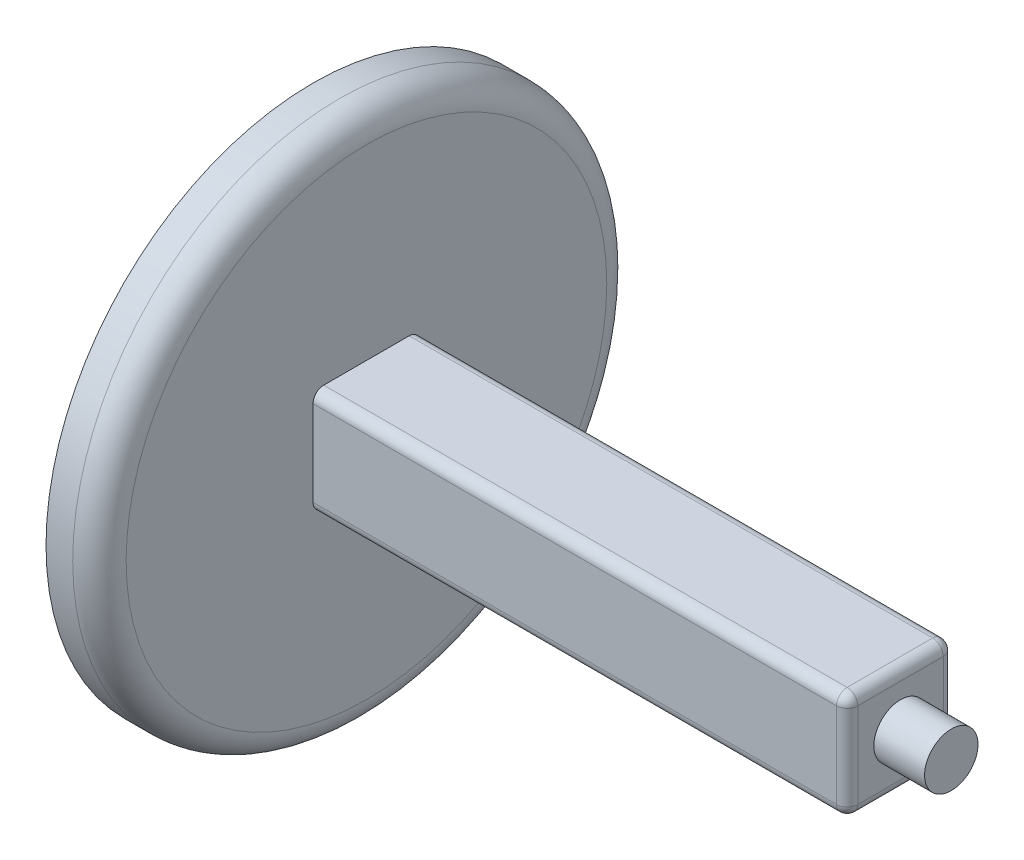
ISO-10303-21;
HEADER;
FILE_DESCRIPTION(('STEP AP214'),'2;1');
FILE_NAME('part.step','',(''),(''),'','','');
FILE_SCHEMA(('AUTOMOTIVE_DESIGN { 1 0 10303 214 1 1 1 1 }'));
ENDSEC;
DATA;
#1=APPLICATION_CONTEXT('core data for automotive mechanical design processes');
#2=APPLICATION_PROTOCOL_DEFINITION('international standard','automotive_design',2000,#1);
#3=PRODUCT_CONTEXT('',#1,'mechanical');
#4=PRODUCT('Part','Part','',(#3));
#5=PRODUCT_RELATED_PRODUCT_CATEGORY('part','',(#4));
#6=PRODUCT_DEFINITION_FORMATION('','',#4);
#7=PRODUCT_DEFINITION_CONTEXT('part definition',#1,'design');
#8=PRODUCT_DEFINITION('design','',#6,#7);
#9=PRODUCT_DEFINITION_SHAPE('','',#8);
#10=(LENGTH_UNIT() NAMED_UNIT(*) SI_UNIT(.MILLI.,.METRE.));
#11=(NAMED_UNIT(*) PLANE_ANGLE_UNIT() SI_UNIT($,.RADIAN.));
#12=(NAMED_UNIT(*) SI_UNIT($,.STERADIAN.) SOLID_ANGLE_UNIT());
#13=UNCERTAINTY_MEASURE_WITH_UNIT(LENGTH_MEASURE(1.E-05),#10,'distance_accuracy_value','');
#14=(GEOMETRIC_REPRESENTATION_CONTEXT(3) GLOBAL_UNCERTAINTY_ASSIGNED_CONTEXT((#13)) GLOBAL_UNIT_ASSIGNED_CONTEXT((#10,
#11,#12)) REPRESENTATION_CONTEXT('',''));
#15=CARTESIAN_POINT('',(0.,0.,0.));
#16=DIRECTION('',(0.,0.,1.));
#17=DIRECTION('',(1.,0.,0.));
#18=AXIS2_PLACEMENT_3D('',#15,#16,#17);
#19=CARTESIAN_POINT('',(100.,0.,0.));
#20=DIRECTION('',(-1.,0.,0.));
#21=DIRECTION('',(0.,0.,1.));
#22=AXIS2_PLACEMENT_3D('',#19,#20,#21);
#23=CYLINDRICAL_SURFACE('',#22,500.);
#24=CARTESIAN_POINT('',(50.,0.,0.));
#25=DIRECTION('',(1.,0.,0.));
#26=DIRECTION('',(0.,0.,-1.));
#27=AXIS2_PLACEMENT_3D('',#24,#25,#26);
#28=CIRCLE('',#27,500.);
#29=CARTESIAN_POINT('',(50.,0.,-500.));
#30=VERTEX_POINT('',#29);
#31=EDGE_CURVE('E163',#30,#30,#28,.F.);
#32=ORIENTED_EDGE('',*,*,#31,.T.);
#33=EDGE_LOOP('',(#32));
#34=FACE_BOUND('',#33,.T.);
#35=CARTESIAN_POINT('',(0.,0.,0.));
#36=DIRECTION('',(1.,0.,0.));
#37=DIRECTION('',(0.,0.,-1.));
#38=AXIS2_PLACEMENT_3D('',#35,#36,#37);
#39=CIRCLE('',#38,500.);
#40=CARTESIAN_POINT('',(0.,0.,-500.));
#41=VERTEX_POINT('',#40);
#42=EDGE_CURVE('E156',#41,#41,#39,.T.);
#43=ORIENTED_EDGE('',*,*,#42,.T.);
#44=EDGE_LOOP('',(#43));
#45=FACE_BOUND('',#44,.T.);
#46=ADVANCED_FACE('F35',(#34,#45),#23,.T.);
#47=CARTESIAN_POINT('',(100.,0.,0.));
#48=DIRECTION('',(1.,0.,0.));
#49=DIRECTION('',(0.,0.,-1.));
#50=AXIS2_PLACEMENT_3D('',#47,#48,#49);
#51=PLANE('',#50);
#52=CARTESIAN_POINT('',(100.,0.,0.));
#53=DIRECTION('',(1.,0.,0.));
#54=DIRECTION('',(0.,0.,-1.));
#55=AXIS2_PLACEMENT_3D('',#52,#53,#54);
#56=CIRCLE('',#55,450.);
#57=CARTESIAN_POINT('',(100.,0.,-450.));
#58=VERTEX_POINT('',#57);
#59=EDGE_CURVE('E160',#58,#58,#56,.T.);
#60=ORIENTED_EDGE('',*,*,#59,.T.);
#61=EDGE_LOOP('',(#60));
#62=FACE_BOUND('',#61,.T.);
#63=DIRECTION('',(0.,1.,0.));
#64=VECTOR('',#63,1.);
#65=CARTESIAN_POINT('',(100.,-100.,-100.));
#66=LINE('',#65,#64);
#67=CARTESIAN_POINT('',(100.,-80.,-100.));
#68=VERTEX_POINT('',#67);
#69=CARTESIAN_POINT('',(100.,80.,-100.));
#70=VERTEX_POINT('',#69);
#71=EDGE_CURVE('E145',#68,#70,#66,.T.);
#72=ORIENTED_EDGE('',*,*,#71,.F.);
#73=CARTESIAN_POINT('',(100.,-80.,-80.));
#74=DIRECTION('',(1.,0.,0.));
#75=DIRECTION('',(0.,0.,-1.));
#76=AXIS2_PLACEMENT_3D('',#73,#74,#75);
#77=CIRCLE('',#76,20.);
#78=CARTESIAN_POINT('',(100.,-100.,-80.));
#79=VERTEX_POINT('',#78);
#80=EDGE_CURVE('E137',#68,#79,#77,.F.);
#81=ORIENTED_EDGE('',*,*,#80,.T.);
#82=DIRECTION('',(0.,0.,-1.));
#83=VECTOR('',#82,1.);
#84=CARTESIAN_POINT('',(100.,-100.,100.));
#85=LINE('',#84,#83);
#86=CARTESIAN_POINT('',(100.,-100.,80.));
#87=VERTEX_POINT('',#86);
#88=EDGE_CURVE('E148',#87,#79,#85,.T.);
#89=ORIENTED_EDGE('',*,*,#88,.F.);
#90=CARTESIAN_POINT('',(100.,-80.,80.));
#91=DIRECTION('',(1.,0.,0.));
#92=DIRECTION('',(0.,0.,-1.));
#93=AXIS2_PLACEMENT_3D('',#90,#91,#92);
#94=CIRCLE('',#93,20.);
#95=CARTESIAN_POINT('',(100.,-80.,100.));
#96=VERTEX_POINT('',#95);
#97=EDGE_CURVE('E178',#87,#96,#94,.F.);
#98=ORIENTED_EDGE('',*,*,#97,.T.);
#99=DIRECTION('',(0.,-1.,0.));
#100=VECTOR('',#99,1.);
#101=CARTESIAN_POINT('',(100.,-100.,100.));
#102=LINE('',#101,#100);
#103=CARTESIAN_POINT('',(100.,80.,100.));
#104=VERTEX_POINT('',#103);
#105=EDGE_CURVE('E144',#104,#96,#102,.T.);
#106=ORIENTED_EDGE('',*,*,#105,.F.);
#107=CARTESIAN_POINT('',(100.,80.,80.));
#108=DIRECTION('',(1.,0.,0.));
#109=DIRECTION('',(0.,0.,-1.));
#110=AXIS2_PLACEMENT_3D('',#107,#108,#109);
#111=CIRCLE('',#110,20.);
#112=CARTESIAN_POINT('',(100.,100.,80.));
#113=VERTEX_POINT('',#112);
#114=EDGE_CURVE('E143',#104,#113,#111,.F.);
#115=ORIENTED_EDGE('',*,*,#114,.T.);
#116=DIRECTION('',(0.,0.,1.));
#117=VECTOR('',#116,1.);
#118=CARTESIAN_POINT('',(100.,100.,100.));
#119=LINE('',#118,#117);
#120=CARTESIAN_POINT('',(100.,100.,-80.));
#121=VERTEX_POINT('',#120);
#122=EDGE_CURVE('E121',#121,#113,#119,.T.);
#123=ORIENTED_EDGE('',*,*,#122,.F.);
#124=CARTESIAN_POINT('',(100.,80.,-80.));
#125=DIRECTION('',(1.,0.,0.));
#126=DIRECTION('',(0.,0.,-1.));
#127=AXIS2_PLACEMENT_3D('',#124,#125,#126);
#128=CIRCLE('',#127,20.);
#129=EDGE_CURVE('E130',#121,#70,#128,.F.);
#130=ORIENTED_EDGE('',*,*,#129,.T.);
#131=EDGE_LOOP('',(#72,#81,#89,#98,#106,#115,#123,#130));
#132=FACE_BOUND('',#131,.T.);
#133=ADVANCED_FACE('F140',(#62,#132),#51,.T.);
#134=CARTESIAN_POINT('',(0.,0.,0.));
#135=DIRECTION('',(1.,0.,0.));
#136=DIRECTION('',(0.,0.,-1.));
#137=AXIS2_PLACEMENT_3D('',#134,#135,#136);
#138=PLANE('',#137);
#139=ORIENTED_EDGE('',*,*,#42,.F.);
#140=EDGE_LOOP('',(#139));
#141=FACE_BOUND('',#140,.T.);
#142=ADVANCED_FACE('F258',(#141),#138,.F.);
#143=CARTESIAN_POINT('',(1100.,-100.,-100.));
#144=DIRECTION('',(0.,0.,1.));
#145=DIRECTION('',(1.,0.,0.));
#146=AXIS2_PLACEMENT_3D('',#143,#144,#145);
#147=PLANE('',#146);
#148=DIRECTION('',(-1.,0.,0.));
#149=VECTOR('',#148,1.);
#150=CARTESIAN_POINT('',(1100.,80.,-100.));
#151=LINE('',#150,#149);
#152=CARTESIAN_POINT('',(1080.,80.,-100.));
#153=VERTEX_POINT('',#152);
#154=EDGE_CURVE('E133',#70,#153,#151,.F.);
#155=ORIENTED_EDGE('',*,*,#154,.T.);
#156=DIRECTION('',(0.,1.,0.));
#157=VECTOR('',#156,1.);
#158=CARTESIAN_POINT('',(1080.,-100.,-100.));
#159=LINE('',#158,#157);
#160=CARTESIAN_POINT('',(1080.,-80.,-100.));
#161=VERTEX_POINT('',#160);
#162=EDGE_CURVE('E191',#153,#161,#159,.F.);
#163=ORIENTED_EDGE('',*,*,#162,.T.);
#164=DIRECTION('',(-1.,0.,0.));
#165=VECTOR('',#164,1.);
#166=CARTESIAN_POINT('',(1100.,-80.,-100.));
#167=LINE('',#166,#165);
#168=EDGE_CURVE('E126',#161,#68,#167,.T.);
#169=ORIENTED_EDGE('',*,*,#168,.T.);
#170=ORIENTED_EDGE('',*,*,#71,.T.);
#171=EDGE_LOOP('',(#155,#163,#169,#170));
#172=FACE_BOUND('',#171,.T.);
#173=ADVANCED_FACE('F323',(#172),#147,.F.);
#174=CARTESIAN_POINT('',(1100.,100.,100.));
#175=DIRECTION('',(0.,-1.,0.));
#176=DIRECTION('',(0.,0.,-1.));
#177=AXIS2_PLACEMENT_3D('',#174,#175,#176);
#178=PLANE('',#177);
#179=DIRECTION('',(-1.,0.,0.));
#180=VECTOR('',#179,1.);
#181=CARTESIAN_POINT('',(1100.,100.,80.));
#182=LINE('',#181,#180);
#183=CARTESIAN_POINT('',(1080.,100.,80.));
#184=VERTEX_POINT('',#183);
#185=EDGE_CURVE('E127',#113,#184,#182,.F.);
#186=ORIENTED_EDGE('',*,*,#185,.T.);
#187=DIRECTION('',(0.,0.,1.));
#188=VECTOR('',#187,1.);
#189=CARTESIAN_POINT('',(1080.,100.,100.));
#190=LINE('',#189,#188);
#191=CARTESIAN_POINT('',(1080.,100.,-80.));
#192=VERTEX_POINT('',#191);
#193=EDGE_CURVE('E124',#184,#192,#190,.F.);
#194=ORIENTED_EDGE('',*,*,#193,.T.);
#195=DIRECTION('',(-1.,0.,0.));
#196=VECTOR('',#195,1.);
#197=CARTESIAN_POINT('',(1100.,100.,-80.));
#198=LINE('',#197,#196);
#199=EDGE_CURVE('E116',#192,#121,#198,.T.);
#200=ORIENTED_EDGE('',*,*,#199,.T.);
#201=ORIENTED_EDGE('',*,*,#122,.T.);
#202=EDGE_LOOP('',(#186,#194,#200,#201));
#203=FACE_BOUND('',#202,.T.);
#204=ADVANCED_FACE('F119',(#203),#178,.F.);
#205=CARTESIAN_POINT('',(1100.,-100.,100.));
#206=DIRECTION('',(0.,0.,-1.));
#207=DIRECTION('',(-1.,0.,0.));
#208=AXIS2_PLACEMENT_3D('',#205,#206,#207);
#209=PLANE('',#208);
#210=DIRECTION('',(-1.,0.,0.));
#211=VECTOR('',#210,1.);
#212=CARTESIAN_POINT('',(1100.,-80.,100.));
#213=LINE('',#212,#211);
#214=CARTESIAN_POINT('',(1080.,-80.,100.));
#215=VERTEX_POINT('',#214);
#216=EDGE_CURVE('E138',#96,#215,#213,.F.);
#217=ORIENTED_EDGE('',*,*,#216,.T.);
#218=DIRECTION('',(0.,-1.,0.));
#219=VECTOR('',#218,1.);
#220=CARTESIAN_POINT('',(1080.,-100.,100.));
#221=LINE('',#220,#219);
#222=CARTESIAN_POINT('',(1080.,80.,100.));
#223=VERTEX_POINT('',#222);
#224=EDGE_CURVE('E52',#215,#223,#221,.F.);
#225=ORIENTED_EDGE('',*,*,#224,.T.);
#226=DIRECTION('',(-1.,0.,0.));
#227=VECTOR('',#226,1.);
#228=CARTESIAN_POINT('',(1100.,80.,100.));
#229=LINE('',#228,#227);
#230=EDGE_CURVE('E174',#223,#104,#229,.T.);
#231=ORIENTED_EDGE('',*,*,#230,.T.);
#232=ORIENTED_EDGE('',*,*,#105,.T.);
#233=EDGE_LOOP('',(#217,#225,#231,#232));
#234=FACE_BOUND('',#233,.T.);
#235=ADVANCED_FACE('F247',(#234),#209,.F.);
#236=CARTESIAN_POINT('',(1100.,-100.,100.));
#237=DIRECTION('',(0.,1.,0.));
#238=DIRECTION('',(0.,0.,1.));
#239=AXIS2_PLACEMENT_3D('',#236,#237,#238);
#240=PLANE('',#239);
#241=DIRECTION('',(-1.,0.,0.));
#242=VECTOR('',#241,1.);
#243=CARTESIAN_POINT('',(1100.,-100.,-80.));
#244=LINE('',#243,#242);
#245=CARTESIAN_POINT('',(1080.,-100.,-80.));
#246=VERTEX_POINT('',#245);
#247=EDGE_CURVE('E171',#79,#246,#244,.F.);
#248=ORIENTED_EDGE('',*,*,#247,.T.);
#249=DIRECTION('',(0.,0.,-1.));
#250=VECTOR('',#249,1.);
#251=CARTESIAN_POINT('',(1080.,-100.,100.));
#252=LINE('',#251,#250);
#253=CARTESIAN_POINT('',(1080.,-100.,80.));
#254=VERTEX_POINT('',#253);
#255=EDGE_CURVE('E193',#246,#254,#252,.F.);
#256=ORIENTED_EDGE('',*,*,#255,.T.);
#257=DIRECTION('',(-1.,0.,0.));
#258=VECTOR('',#257,1.);
#259=CARTESIAN_POINT('',(1100.,-100.,80.));
#260=LINE('',#259,#258);
#261=EDGE_CURVE('E169',#254,#87,#260,.T.);
#262=ORIENTED_EDGE('',*,*,#261,.T.);
#263=ORIENTED_EDGE('',*,*,#88,.T.);
#264=EDGE_LOOP('',(#248,#256,#262,#263));
#265=FACE_BOUND('',#264,.T.);
#266=ADVANCED_FACE('F236',(#265),#240,.F.);
#267=CARTESIAN_POINT('',(1100.,0.,0.));
#268=DIRECTION('',(-1.,0.,0.));
#269=DIRECTION('',(0.,0.,1.));
#270=AXIS2_PLACEMENT_3D('',#267,#268,#269);
#271=PLANE('',#270);
#272=DIRECTION('',(0.,1.,0.));
#273=VECTOR('',#272,1.);
#274=CARTESIAN_POINT('',(1100.,0.,-80.));
#275=LINE('',#274,#273);
#276=CARTESIAN_POINT('',(1100.,-80.,-80.));
#277=VERTEX_POINT('',#276);
#278=CARTESIAN_POINT('',(1100.,80.,-80.));
#279=VERTEX_POINT('',#278);
#280=EDGE_CURVE('E185',#277,#279,#275,.T.);
#281=ORIENTED_EDGE('',*,*,#280,.T.);
#282=DIRECTION('',(0.,0.,1.));
#283=VECTOR('',#282,1.);
#284=CARTESIAN_POINT('',(1100.,80.,0.));
#285=LINE('',#284,#283);
#286=CARTESIAN_POINT('',(1100.,80.,80.));
#287=VERTEX_POINT('',#286);
#288=EDGE_CURVE('E187',#279,#287,#285,.T.);
#289=ORIENTED_EDGE('',*,*,#288,.T.);
#290=DIRECTION('',(0.,-1.,0.));
#291=VECTOR('',#290,1.);
#292=CARTESIAN_POINT('',(1100.,0.,80.));
#293=LINE('',#292,#291);
#294=CARTESIAN_POINT('',(1100.,-80.,80.));
#295=VERTEX_POINT('',#294);
#296=EDGE_CURVE('E181',#287,#295,#293,.T.);
#297=ORIENTED_EDGE('',*,*,#296,.T.);
#298=DIRECTION('',(0.,0.,-1.));
#299=VECTOR('',#298,1.);
#300=CARTESIAN_POINT('',(1100.,-80.,0.));
#301=LINE('',#300,#299);
#302=EDGE_CURVE('E183',#295,#277,#301,.T.);
#303=ORIENTED_EDGE('',*,*,#302,.T.);
#304=EDGE_LOOP('',(#281,#289,#297,#303));
#305=FACE_BOUND('',#304,.T.);
#306=CARTESIAN_POINT('',(1100.,0.,0.));
#307=DIRECTION('',(1.,0.,0.));
#308=DIRECTION('',(0.,0.,-1.));
#309=AXIS2_PLACEMENT_3D('',#306,#307,#308);
#310=CIRCLE('',#309,50.);
#311=CARTESIAN_POINT('',(1100.,0.,-50.));
#312=VERTEX_POINT('',#311);
#313=EDGE_CURVE('E159',#312,#312,#310,.T.);
#314=ORIENTED_EDGE('',*,*,#313,.F.);
#315=EDGE_LOOP('',(#314));
#316=FACE_BOUND('',#315,.T.);
#317=ADVANCED_FACE('F234',(#305,#316),#271,.F.);
#318=CARTESIAN_POINT('',(1195.,0.,0.));
#319=DIRECTION('',(-1.,0.,0.));
#320=DIRECTION('',(0.,0.,1.));
#321=AXIS2_PLACEMENT_3D('',#318,#319,#320);
#322=CYLINDRICAL_SURFACE('',#321,50.);
#323=CARTESIAN_POINT('',(1195.,0.,0.));
#324=DIRECTION('',(1.,0.,0.));
#325=DIRECTION('',(0.,0.,-1.));
#326=AXIS2_PLACEMENT_3D('',#323,#324,#325);
#327=CIRCLE('',#326,50.);
#328=CARTESIAN_POINT('',(1195.,0.,-50.));
#329=VERTEX_POINT('',#328);
#330=EDGE_CURVE('E150',#329,#329,#327,.T.);
#331=ORIENTED_EDGE('',*,*,#330,.F.);
#332=EDGE_LOOP('',(#331));
#333=FACE_BOUND('',#332,.T.);
#334=ORIENTED_EDGE('',*,*,#313,.T.);
#335=EDGE_LOOP('',(#334));
#336=FACE_BOUND('',#335,.T.);
#337=ADVANCED_FACE('F232',(#333,#336),#322,.T.);
#338=CARTESIAN_POINT('',(1195.,0.,0.));
#339=DIRECTION('',(1.,0.,0.));
#340=DIRECTION('',(0.,0.,-1.));
#341=AXIS2_PLACEMENT_3D('',#338,#339,#340);
#342=PLANE('',#341);
#343=ORIENTED_EDGE('',*,*,#330,.T.);
#344=EDGE_LOOP('',(#343));
#345=FACE_BOUND('',#344,.T.);
#346=ADVANCED_FACE('F244',(#345),#342,.T.);
#347=CARTESIAN_POINT('',(50.,0.,0.));
#348=DIRECTION('',(1.,0.,0.));
#349=DIRECTION('',(0.,0.,-1.));
#350=AXIS2_PLACEMENT_3D('',#347,#348,#349);
#351=TOROIDAL_SURFACE('',#350,450.,50.);
#352=ORIENTED_EDGE('',*,*,#31,.F.);
#353=EDGE_LOOP('',(#352));
#354=FACE_BOUND('',#353,.T.);
#355=ORIENTED_EDGE('',*,*,#59,.F.);
#356=EDGE_LOOP('',(#355));
#357=FACE_BOUND('',#356,.T.);
#358=ADVANCED_FACE('F264',(#354,#357),#351,.T.);
#359=CARTESIAN_POINT('',(1100.,80.,-80.));
#360=DIRECTION('',(-1.,0.,0.));
#361=DIRECTION('',(0.,0.,1.));
#362=AXIS2_PLACEMENT_3D('',#359,#360,#361);
#363=CYLINDRICAL_SURFACE('',#362,20.);
#364=ORIENTED_EDGE('',*,*,#199,.F.);
#365=CARTESIAN_POINT('',(1080.,80.,-80.));
#366=DIRECTION('',(-1.,0.,0.));
#367=DIRECTION('',(0.,0.,1.));
#368=AXIS2_PLACEMENT_3D('',#365,#366,#367);
#369=CIRCLE('',#368,20.);
#370=EDGE_CURVE('E44',#192,#153,#369,.T.);
#371=ORIENTED_EDGE('',*,*,#370,.T.);
#372=ORIENTED_EDGE('',*,*,#154,.F.);
#373=ORIENTED_EDGE('',*,*,#129,.F.);
#374=EDGE_LOOP('',(#364,#371,#372,#373));
#375=FACE_BOUND('',#374,.T.);
#376=ADVANCED_FACE('F131',(#375),#363,.T.);
#377=CARTESIAN_POINT('',(1100.,-80.,-80.));
#378=DIRECTION('',(-1.,0.,0.));
#379=DIRECTION('',(0.,0.,1.));
#380=AXIS2_PLACEMENT_3D('',#377,#378,#379);
#381=CYLINDRICAL_SURFACE('',#380,20.);
#382=ORIENTED_EDGE('',*,*,#168,.F.);
#383=CARTESIAN_POINT('',(1080.,-80.,-80.));
#384=DIRECTION('',(-1.,0.,0.));
#385=DIRECTION('',(0.,0.,1.));
#386=AXIS2_PLACEMENT_3D('',#383,#384,#385);
#387=CIRCLE('',#386,20.);
#388=EDGE_CURVE('E196',#161,#246,#387,.T.);
#389=ORIENTED_EDGE('',*,*,#388,.T.);
#390=ORIENTED_EDGE('',*,*,#247,.F.);
#391=ORIENTED_EDGE('',*,*,#80,.F.);
#392=EDGE_LOOP('',(#382,#389,#390,#391));
#393=FACE_BOUND('',#392,.T.);
#394=ADVANCED_FACE('F270',(#393),#381,.T.);
#395=CARTESIAN_POINT('',(1100.,-80.,80.));
#396=DIRECTION('',(-1.,0.,0.));
#397=DIRECTION('',(0.,0.,1.));
#398=AXIS2_PLACEMENT_3D('',#395,#396,#397);
#399=CYLINDRICAL_SURFACE('',#398,20.);
#400=ORIENTED_EDGE('',*,*,#261,.F.);
#401=CARTESIAN_POINT('',(1080.,-80.,80.));
#402=DIRECTION('',(-1.,0.,0.));
#403=DIRECTION('',(0.,0.,1.));
#404=AXIS2_PLACEMENT_3D('',#401,#402,#403);
#405=CIRCLE('',#404,20.);
#406=EDGE_CURVE('E60',#254,#215,#405,.T.);
#407=ORIENTED_EDGE('',*,*,#406,.T.);
#408=ORIENTED_EDGE('',*,*,#216,.F.);
#409=ORIENTED_EDGE('',*,*,#97,.F.);
#410=EDGE_LOOP('',(#400,#407,#408,#409));
#411=FACE_BOUND('',#410,.T.);
#412=ADVANCED_FACE('F273',(#411),#399,.T.);
#413=CARTESIAN_POINT('',(1100.,80.,80.));
#414=DIRECTION('',(-1.,0.,0.));
#415=DIRECTION('',(0.,0.,1.));
#416=AXIS2_PLACEMENT_3D('',#413,#414,#415);
#417=CYLINDRICAL_SURFACE('',#416,20.);
#418=ORIENTED_EDGE('',*,*,#230,.F.);
#419=CARTESIAN_POINT('',(1080.,80.,80.));
#420=DIRECTION('',(-1.,0.,0.));
#421=DIRECTION('',(0.,0.,1.));
#422=AXIS2_PLACEMENT_3D('',#419,#420,#421);
#423=CIRCLE('',#422,20.);
#424=EDGE_CURVE('E11',#223,#184,#423,.T.);
#425=ORIENTED_EDGE('',*,*,#424,.T.);
#426=ORIENTED_EDGE('',*,*,#185,.F.);
#427=ORIENTED_EDGE('',*,*,#114,.F.);
#428=EDGE_LOOP('',(#418,#425,#426,#427));
#429=FACE_BOUND('',#428,.T.);
#430=ADVANCED_FACE('F277',(#429),#417,.T.);
#431=CARTESIAN_POINT('',(1080.,-80.,0.));
#432=DIRECTION('',(0.,0.,-1.));
#433=DIRECTION('',(-1.,0.,0.));
#434=AXIS2_PLACEMENT_3D('',#431,#432,#433);
#435=CYLINDRICAL_SURFACE('',#434,20.);
#436=CARTESIAN_POINT('',(1080.,-80.,80.));
#437=DIRECTION('',(0.,0.,1.));
#438=DIRECTION('',(1.,0.,0.));
#439=AXIS2_PLACEMENT_3D('',#436,#437,#438);
#440=CIRCLE('',#439,20.);
#441=EDGE_CURVE('E215',#254,#295,#440,.T.);
#442=ORIENTED_EDGE('',*,*,#441,.F.);
#443=ORIENTED_EDGE('',*,*,#255,.F.);
#444=CARTESIAN_POINT('',(1080.,-80.,-80.));
#445=DIRECTION('',(0.,0.,-1.));
#446=DIRECTION('',(-1.,0.,0.));
#447=AXIS2_PLACEMENT_3D('',#444,#445,#446);
#448=CIRCLE('',#447,20.);
#449=EDGE_CURVE('E39',#277,#246,#448,.T.);
#450=ORIENTED_EDGE('',*,*,#449,.F.);
#451=ORIENTED_EDGE('',*,*,#302,.F.);
#452=EDGE_LOOP('',(#442,#443,#450,#451));
#453=FACE_BOUND('',#452,.T.);
#454=ADVANCED_FACE('F37',(#453),#435,.T.);
#455=CARTESIAN_POINT('',(1080.,-80.,-80.));
#456=DIRECTION('',(-1.,0.,0.));
#457=DIRECTION('',(0.,0.,1.));
#458=AXIS2_PLACEMENT_3D('',#455,#456,#457);
#459=SPHERICAL_SURFACE('',#458,20.);
#460=ORIENTED_EDGE('',*,*,#449,.T.);
#461=ORIENTED_EDGE('',*,*,#388,.F.);
#462=CARTESIAN_POINT('',(1080.,-80.,-80.));
#463=DIRECTION('',(0.,1.,0.));
#464=DIRECTION('',(0.,0.,1.));
#465=AXIS2_PLACEMENT_3D('',#462,#463,#464);
#466=CIRCLE('',#465,20.);
#467=EDGE_CURVE('E213',#277,#161,#466,.T.);
#468=ORIENTED_EDGE('',*,*,#467,.F.);
#469=EDGE_LOOP('',(#460,#461,#468));
#470=FACE_BOUND('',#469,.T.);
#471=ADVANCED_FACE('F303',(#470),#459,.T.);
#472=CARTESIAN_POINT('',(1080.,-80.,80.));
#473=DIRECTION('',(-1.,0.,0.));
#474=DIRECTION('',(0.,0.,1.));
#475=AXIS2_PLACEMENT_3D('',#472,#473,#474);
#476=SPHERICAL_SURFACE('',#475,20.);
#477=ORIENTED_EDGE('',*,*,#406,.F.);
#478=ORIENTED_EDGE('',*,*,#441,.T.);
#479=CARTESIAN_POINT('',(1080.,-80.,80.));
#480=DIRECTION('',(0.,1.,0.));
#481=DIRECTION('',(0.,0.,1.));
#482=AXIS2_PLACEMENT_3D('',#479,#480,#481);
#483=CIRCLE('',#482,20.);
#484=EDGE_CURVE('E210',#215,#295,#483,.T.);
#485=ORIENTED_EDGE('',*,*,#484,.F.);
#486=EDGE_LOOP('',(#477,#478,#485));
#487=FACE_BOUND('',#486,.T.);
#488=ADVANCED_FACE('F300',(#487),#476,.T.);
#489=CARTESIAN_POINT('',(1080.,0.,-80.));
#490=DIRECTION('',(0.,1.,0.));
#491=DIRECTION('',(0.,0.,1.));
#492=AXIS2_PLACEMENT_3D('',#489,#490,#491);
#493=CYLINDRICAL_SURFACE('',#492,20.);
#494=ORIENTED_EDGE('',*,*,#467,.T.);
#495=ORIENTED_EDGE('',*,*,#162,.F.);
#496=CARTESIAN_POINT('',(1080.,80.,-80.));
#497=DIRECTION('',(0.,1.,0.));
#498=DIRECTION('',(0.,0.,1.));
#499=AXIS2_PLACEMENT_3D('',#496,#497,#498);
#500=CIRCLE('',#499,20.);
#501=EDGE_CURVE('E207',#279,#153,#500,.T.);
#502=ORIENTED_EDGE('',*,*,#501,.F.);
#503=ORIENTED_EDGE('',*,*,#280,.F.);
#504=EDGE_LOOP('',(#494,#495,#502,#503));
#505=FACE_BOUND('',#504,.T.);
#506=ADVANCED_FACE('F296',(#505),#493,.T.);
#507=CARTESIAN_POINT('',(1080.,0.,80.));
#508=DIRECTION('',(0.,-1.,0.));
#509=DIRECTION('',(0.,0.,-1.));
#510=AXIS2_PLACEMENT_3D('',#507,#508,#509);
#511=CYLINDRICAL_SURFACE('',#510,20.);
#512=ORIENTED_EDGE('',*,*,#484,.T.);
#513=ORIENTED_EDGE('',*,*,#296,.F.);
#514=CARTESIAN_POINT('',(1080.,80.,80.));
#515=DIRECTION('',(0.,1.,0.));
#516=DIRECTION('',(0.,0.,1.));
#517=AXIS2_PLACEMENT_3D('',#514,#515,#516);
#518=CIRCLE('',#517,20.);
#519=EDGE_CURVE('E204',#223,#287,#518,.T.);
#520=ORIENTED_EDGE('',*,*,#519,.F.);
#521=ORIENTED_EDGE('',*,*,#224,.F.);
#522=EDGE_LOOP('',(#512,#513,#520,#521));
#523=FACE_BOUND('',#522,.T.);
#524=ADVANCED_FACE('F292',(#523),#511,.T.);
#525=CARTESIAN_POINT('',(1080.,80.,-80.));
#526=DIRECTION('',(-1.,0.,0.));
#527=DIRECTION('',(0.,0.,1.));
#528=AXIS2_PLACEMENT_3D('',#525,#526,#527);
#529=SPHERICAL_SURFACE('',#528,20.);
#530=ORIENTED_EDGE('',*,*,#501,.T.);
#531=ORIENTED_EDGE('',*,*,#370,.F.);
#532=CARTESIAN_POINT('',(1080.,80.,-80.));
#533=DIRECTION('',(0.,0.,1.));
#534=DIRECTION('',(1.,0.,0.));
#535=AXIS2_PLACEMENT_3D('',#532,#533,#534);
#536=CIRCLE('',#535,20.);
#537=EDGE_CURVE('E202',#279,#192,#536,.T.);
#538=ORIENTED_EDGE('',*,*,#537,.F.);
#539=EDGE_LOOP('',(#530,#531,#538));
#540=FACE_BOUND('',#539,.T.);
#541=ADVANCED_FACE('F288',(#540),#529,.T.);
#542=CARTESIAN_POINT('',(1080.,80.,80.));
#543=DIRECTION('',(-1.,0.,0.));
#544=DIRECTION('',(0.,0.,1.));
#545=AXIS2_PLACEMENT_3D('',#542,#543,#544);
#546=SPHERICAL_SURFACE('',#545,20.);
#547=ORIENTED_EDGE('',*,*,#424,.F.);
#548=ORIENTED_EDGE('',*,*,#519,.T.);
#549=CARTESIAN_POINT('',(1080.,80.,80.));
#550=DIRECTION('',(0.,0.,-1.));
#551=DIRECTION('',(-1.,0.,0.));
#552=AXIS2_PLACEMENT_3D('',#549,#550,#551);
#553=CIRCLE('',#552,20.);
#554=EDGE_CURVE('E200',#184,#287,#553,.T.);
#555=ORIENTED_EDGE('',*,*,#554,.F.);
#556=EDGE_LOOP('',(#547,#548,#555));
#557=FACE_BOUND('',#556,.T.);
#558=ADVANCED_FACE('F284',(#557),#546,.T.);
#559=CARTESIAN_POINT('',(1080.,80.,0.));
#560=DIRECTION('',(0.,0.,1.));
#561=DIRECTION('',(1.,0.,0.));
#562=AXIS2_PLACEMENT_3D('',#559,#560,#561);
#563=CYLINDRICAL_SURFACE('',#562,20.);
#564=ORIENTED_EDGE('',*,*,#537,.T.);
#565=ORIENTED_EDGE('',*,*,#193,.F.);
#566=ORIENTED_EDGE('',*,*,#554,.T.);
#567=ORIENTED_EDGE('',*,*,#288,.F.);
#568=EDGE_LOOP('',(#564,#565,#566,#567));
#569=FACE_BOUND('',#568,.T.);
#570=ADVANCED_FACE('F281',(#569),#563,.T.);
#571=CLOSED_SHELL('',(#46,#133,#142,#173,#204,#235,#266,#317,#337,#346,#358,#376,#394,#412,#430,
#454,#471,#488,#506,#524,#541,#558,#570));
#572=MANIFOLD_SOLID_BREP('B2',#571);
#573=ADVANCED_BREP_SHAPE_REPRESENTATION('',(#18,#572),#14);
#574=SHAPE_DEFINITION_REPRESENTATION(#9,#573);
ENDSEC;
END-ISO-10303-21;
